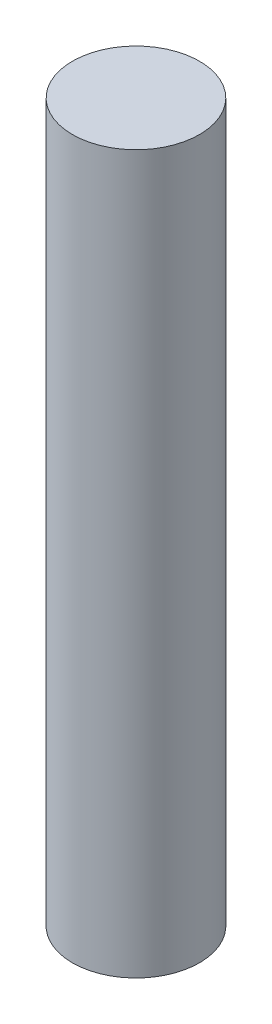
ISO-10303-21;
HEADER;
FILE_DESCRIPTION(('STEP AP214'),'2;1');
FILE_NAME('part.step','',(''),(''),'','','');
FILE_SCHEMA(('AUTOMOTIVE_DESIGN { 1 0 10303 214 1 1 1 1 }'));
ENDSEC;
DATA;
#1=APPLICATION_CONTEXT('core data for automotive mechanical design processes');
#2=APPLICATION_PROTOCOL_DEFINITION('international standard','automotive_design',2000,#1);
#3=PRODUCT_CONTEXT('',#1,'mechanical');
#4=PRODUCT('Part','Part','',(#3));
#5=PRODUCT_RELATED_PRODUCT_CATEGORY('part','',(#4));
#6=PRODUCT_DEFINITION_FORMATION('','',#4);
#7=PRODUCT_DEFINITION_CONTEXT('part definition',#1,'design');
#8=PRODUCT_DEFINITION('design','',#6,#7);
#9=PRODUCT_DEFINITION_SHAPE('','',#8);
#10=(LENGTH_UNIT() NAMED_UNIT(*) SI_UNIT(.MILLI.,.METRE.));
#11=(NAMED_UNIT(*) PLANE_ANGLE_UNIT() SI_UNIT($,.RADIAN.));
#12=(NAMED_UNIT(*) SI_UNIT($,.STERADIAN.) SOLID_ANGLE_UNIT());
#13=UNCERTAINTY_MEASURE_WITH_UNIT(LENGTH_MEASURE(1.E-05),#10,'distance_accuracy_value','');
#14=(GEOMETRIC_REPRESENTATION_CONTEXT(3) GLOBAL_UNCERTAINTY_ASSIGNED_CONTEXT((#13)) GLOBAL_UNIT_ASSIGNED_CONTEXT((#10,
#11,#12)) REPRESENTATION_CONTEXT('',''));
#15=CARTESIAN_POINT('',(0.,0.,0.));
#16=DIRECTION('',(0.,0.,1.));
#17=DIRECTION('',(1.,0.,0.));
#18=AXIS2_PLACEMENT_3D('',#15,#16,#17);
#19=CARTESIAN_POINT('',(0.,254.,0.));
#20=DIRECTION('',(0.,-1.,0.));
#21=DIRECTION('',(0.,0.,-1.));
#22=AXIS2_PLACEMENT_3D('',#19,#20,#21);
#23=CYLINDRICAL_SURFACE('',#22,22.5);
#24=CARTESIAN_POINT('',(0.,254.,0.));
#25=DIRECTION('',(0.,1.,0.));
#26=DIRECTION('',(0.,0.,1.));
#27=AXIS2_PLACEMENT_3D('',#24,#25,#26);
#28=CIRCLE('',#27,22.5);
#29=CARTESIAN_POINT('',(0.,254.,22.5));
#30=VERTEX_POINT('',#29);
#31=EDGE_CURVE('E10',#30,#30,#28,.T.);
#32=ORIENTED_EDGE('',*,*,#31,.F.);
#33=EDGE_LOOP('',(#32));
#34=FACE_BOUND('',#33,.T.);
#35=CARTESIAN_POINT('',(0.,0.,0.));
#36=DIRECTION('',(0.,1.,0.));
#37=DIRECTION('',(0.,0.,1.));
#38=AXIS2_PLACEMENT_3D('',#35,#36,#37);
#39=CIRCLE('',#38,22.5);
#40=CARTESIAN_POINT('',(0.,0.,22.5));
#41=VERTEX_POINT('',#40);
#42=EDGE_CURVE('E38',#41,#41,#39,.T.);
#43=ORIENTED_EDGE('',*,*,#42,.T.);
#44=EDGE_LOOP('',(#43));
#45=FACE_BOUND('',#44,.T.);
#46=ADVANCED_FACE('F35',(#34,#45),#23,.T.);
#47=CARTESIAN_POINT('',(0.,254.,0.));
#48=DIRECTION('',(0.,1.,0.));
#49=DIRECTION('',(0.,0.,1.));
#50=AXIS2_PLACEMENT_3D('',#47,#48,#49);
#51=PLANE('',#50);
#52=ORIENTED_EDGE('',*,*,#31,.T.);
#53=EDGE_LOOP('',(#52));
#54=FACE_BOUND('',#53,.T.);
#55=ADVANCED_FACE('F50',(#54),#51,.T.);
#56=CARTESIAN_POINT('',(0.,0.,0.));
#57=DIRECTION('',(0.,1.,0.));
#58=DIRECTION('',(0.,0.,1.));
#59=AXIS2_PLACEMENT_3D('',#56,#57,#58);
#60=PLANE('',#59);
#61=ORIENTED_EDGE('',*,*,#42,.F.);
#62=EDGE_LOOP('',(#61));
#63=FACE_BOUND('',#62,.T.);
#64=ADVANCED_FACE('F48',(#63),#60,.F.);
#65=CLOSED_SHELL('',(#46,#55,#64));
#66=MANIFOLD_SOLID_BREP('B2',#65);
#67=ADVANCED_BREP_SHAPE_REPRESENTATION('',(#18,#66),#14);
#68=SHAPE_DEFINITION_REPRESENTATION(#9,#67);
ENDSEC;
END-ISO-10303-21;
